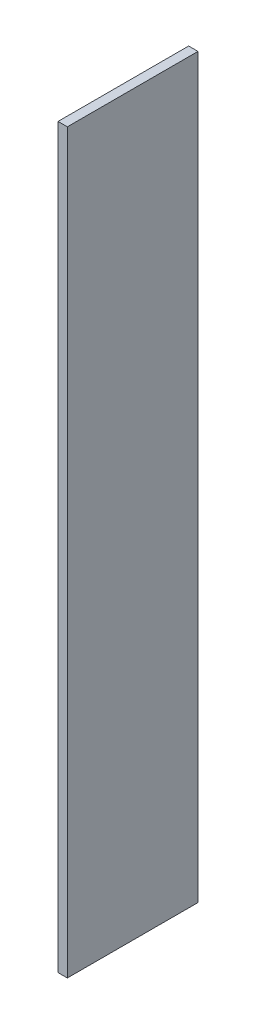
ISO-10303-21;
HEADER;
FILE_DESCRIPTION(('STEP AP214'),'2;1');
FILE_NAME('part.step','',(''),(''),'','','');
FILE_SCHEMA(('AUTOMOTIVE_DESIGN { 1 0 10303 214 1 1 1 1 }'));
ENDSEC;
DATA;
#1=APPLICATION_CONTEXT('core data for automotive mechanical design processes');
#2=APPLICATION_PROTOCOL_DEFINITION('international standard','automotive_design',2000,#1);
#3=PRODUCT_CONTEXT('',#1,'mechanical');
#4=PRODUCT('Part','Part','',(#3));
#5=PRODUCT_RELATED_PRODUCT_CATEGORY('part','',(#4));
#6=PRODUCT_DEFINITION_FORMATION('','',#4);
#7=PRODUCT_DEFINITION_CONTEXT('part definition',#1,'design');
#8=PRODUCT_DEFINITION('design','',#6,#7);
#9=PRODUCT_DEFINITION_SHAPE('','',#8);
#10=(LENGTH_UNIT() NAMED_UNIT(*) SI_UNIT(.MILLI.,.METRE.));
#11=(NAMED_UNIT(*) PLANE_ANGLE_UNIT() SI_UNIT($,.RADIAN.));
#12=(NAMED_UNIT(*) SI_UNIT($,.STERADIAN.) SOLID_ANGLE_UNIT());
#13=UNCERTAINTY_MEASURE_WITH_UNIT(LENGTH_MEASURE(1.E-05),#10,'distance_accuracy_value','');
#14=(GEOMETRIC_REPRESENTATION_CONTEXT(3) GLOBAL_UNCERTAINTY_ASSIGNED_CONTEXT((#13)) GLOBAL_UNIT_ASSIGNED_CONTEXT((#10,
#11,#12)) REPRESENTATION_CONTEXT('',''));
#15=CARTESIAN_POINT('',(0.,0.,0.));
#16=DIRECTION('',(0.,0.,1.));
#17=DIRECTION('',(1.,0.,0.));
#18=AXIS2_PLACEMENT_3D('',#15,#16,#17);
#19=CARTESIAN_POINT('',(6.35,0.,0.));
#20=DIRECTION('',(0.,0.,-1.));
#21=DIRECTION('',(-1.,0.,0.));
#22=AXIS2_PLACEMENT_3D('',#19,#20,#21);
#23=PLANE('',#22);
#24=DIRECTION('',(0.,-1.,0.));
#25=VECTOR('',#24,1.);
#26=CARTESIAN_POINT('',(0.,0.,0.));
#27=LINE('',#26,#25);
#28=CARTESIAN_POINT('',(0.,501.65,0.));
#29=VERTEX_POINT('',#28);
#30=CARTESIAN_POINT('',(0.,0.,0.));
#31=VERTEX_POINT('',#30);
#32=EDGE_CURVE('E97',#29,#31,#27,.T.);
#33=ORIENTED_EDGE('',*,*,#32,.T.);
#34=DIRECTION('',(-1.,0.,0.));
#35=VECTOR('',#34,1.);
#36=CARTESIAN_POINT('',(6.35,0.,0.));
#37=LINE('',#36,#35);
#38=CARTESIAN_POINT('',(6.35,0.,0.));
#39=VERTEX_POINT('',#38);
#40=EDGE_CURVE('E11',#39,#31,#37,.T.);
#41=ORIENTED_EDGE('',*,*,#40,.F.);
#42=DIRECTION('',(0.,-1.,0.));
#43=VECTOR('',#42,1.);
#44=CARTESIAN_POINT('',(6.35,0.,0.));
#45=LINE('',#44,#43);
#46=CARTESIAN_POINT('',(6.35,501.65,0.));
#47=VERTEX_POINT('',#46);
#48=EDGE_CURVE('E85',#47,#39,#45,.T.);
#49=ORIENTED_EDGE('',*,*,#48,.F.);
#50=DIRECTION('',(-1.,0.,0.));
#51=VECTOR('',#50,1.);
#52=CARTESIAN_POINT('',(6.35,501.65,0.));
#53=LINE('',#52,#51);
#54=EDGE_CURVE('E93',#47,#29,#53,.T.);
#55=ORIENTED_EDGE('',*,*,#54,.T.);
#56=EDGE_LOOP('',(#33,#41,#49,#55));
#57=FACE_BOUND('',#56,.T.);
#58=ADVANCED_FACE('F34',(#57),#23,.F.);
#59=CARTESIAN_POINT('',(6.35,0.,0.));
#60=DIRECTION('',(0.,1.,0.));
#61=DIRECTION('',(0.,0.,1.));
#62=AXIS2_PLACEMENT_3D('',#59,#60,#61);
#63=PLANE('',#62);
#64=DIRECTION('',(0.,0.,-1.));
#65=VECTOR('',#64,1.);
#66=CARTESIAN_POINT('',(0.,0.,0.));
#67=LINE('',#66,#65);
#68=CARTESIAN_POINT('',(0.,0.,-88.9));
#69=VERTEX_POINT('',#68);
#70=EDGE_CURVE('E89',#31,#69,#67,.T.);
#71=ORIENTED_EDGE('',*,*,#70,.T.);
#72=DIRECTION('',(-1.,0.,0.));
#73=VECTOR('',#72,1.);
#74=CARTESIAN_POINT('',(6.35,0.,-88.9));
#75=LINE('',#74,#73);
#76=CARTESIAN_POINT('',(6.35,0.,-88.9));
#77=VERTEX_POINT('',#76);
#78=EDGE_CURVE('E42',#77,#69,#75,.T.);
#79=ORIENTED_EDGE('',*,*,#78,.F.);
#80=DIRECTION('',(0.,0.,-1.));
#81=VECTOR('',#80,1.);
#82=CARTESIAN_POINT('',(6.35,0.,0.));
#83=LINE('',#82,#81);
#84=EDGE_CURVE('E80',#39,#77,#83,.T.);
#85=ORIENTED_EDGE('',*,*,#84,.F.);
#86=ORIENTED_EDGE('',*,*,#40,.T.);
#87=EDGE_LOOP('',(#71,#79,#85,#86));
#88=FACE_BOUND('',#87,.T.);
#89=ADVANCED_FACE('F88',(#88),#63,.F.);
#90=CARTESIAN_POINT('',(6.35,0.,-88.9));
#91=DIRECTION('',(0.,0.,1.));
#92=DIRECTION('',(1.,0.,0.));
#93=AXIS2_PLACEMENT_3D('',#90,#91,#92);
#94=PLANE('',#93);
#95=DIRECTION('',(0.,1.,0.));
#96=VECTOR('',#95,1.);
#97=CARTESIAN_POINT('',(0.,0.,-88.9));
#98=LINE('',#97,#96);
#99=CARTESIAN_POINT('',(0.,501.65,-88.9));
#100=VERTEX_POINT('',#99);
#101=EDGE_CURVE('E67',#69,#100,#98,.T.);
#102=ORIENTED_EDGE('',*,*,#101,.T.);
#103=DIRECTION('',(-1.,0.,0.));
#104=VECTOR('',#103,1.);
#105=CARTESIAN_POINT('',(6.35,501.65,-88.9));
#106=LINE('',#105,#104);
#107=CARTESIAN_POINT('',(6.35,501.65,-88.9));
#108=VERTEX_POINT('',#107);
#109=EDGE_CURVE('E90',#108,#100,#106,.T.);
#110=ORIENTED_EDGE('',*,*,#109,.F.);
#111=DIRECTION('',(0.,1.,0.));
#112=VECTOR('',#111,1.);
#113=CARTESIAN_POINT('',(6.35,0.,-88.9));
#114=LINE('',#113,#112);
#115=EDGE_CURVE('E83',#77,#108,#114,.T.);
#116=ORIENTED_EDGE('',*,*,#115,.F.);
#117=ORIENTED_EDGE('',*,*,#78,.T.);
#118=EDGE_LOOP('',(#102,#110,#116,#117));
#119=FACE_BOUND('',#118,.T.);
#120=ADVANCED_FACE('F91',(#119),#94,.F.);
#121=CARTESIAN_POINT('',(6.35,501.65,0.));
#122=DIRECTION('',(0.,-1.,0.));
#123=DIRECTION('',(0.,0.,-1.));
#124=AXIS2_PLACEMENT_3D('',#121,#122,#123);
#125=PLANE('',#124);
#126=DIRECTION('',(0.,0.,1.));
#127=VECTOR('',#126,1.);
#128=CARTESIAN_POINT('',(0.,501.65,0.));
#129=LINE('',#128,#127);
#130=EDGE_CURVE('E73',#100,#29,#129,.T.);
#131=ORIENTED_EDGE('',*,*,#130,.T.);
#132=ORIENTED_EDGE('',*,*,#54,.F.);
#133=DIRECTION('',(0.,0.,1.));
#134=VECTOR('',#133,1.);
#135=CARTESIAN_POINT('',(6.35,501.65,0.));
#136=LINE('',#135,#134);
#137=EDGE_CURVE('E50',#108,#47,#136,.T.);
#138=ORIENTED_EDGE('',*,*,#137,.F.);
#139=ORIENTED_EDGE('',*,*,#109,.T.);
#140=EDGE_LOOP('',(#131,#132,#138,#139));
#141=FACE_BOUND('',#140,.T.);
#142=ADVANCED_FACE('F104',(#141),#125,.F.);
#143=CARTESIAN_POINT('',(6.35,0.,0.));
#144=DIRECTION('',(-1.,0.,0.));
#145=DIRECTION('',(0.,0.,1.));
#146=AXIS2_PLACEMENT_3D('',#143,#144,#145);
#147=PLANE('',#146);
#148=ORIENTED_EDGE('',*,*,#48,.T.);
#149=ORIENTED_EDGE('',*,*,#84,.T.);
#150=ORIENTED_EDGE('',*,*,#115,.T.);
#151=ORIENTED_EDGE('',*,*,#137,.T.);
#152=EDGE_LOOP('',(#148,#149,#150,#151));
#153=FACE_BOUND('',#152,.T.);
#154=ADVANCED_FACE('F81',(#153),#147,.F.);
#155=CARTESIAN_POINT('',(0.,0.,0.));
#156=DIRECTION('',(-1.,0.,0.));
#157=DIRECTION('',(0.,0.,1.));
#158=AXIS2_PLACEMENT_3D('',#155,#156,#157);
#159=PLANE('',#158);
#160=ORIENTED_EDGE('',*,*,#32,.F.);
#161=ORIENTED_EDGE('',*,*,#130,.F.);
#162=ORIENTED_EDGE('',*,*,#101,.F.);
#163=ORIENTED_EDGE('',*,*,#70,.F.);
#164=EDGE_LOOP('',(#160,#161,#162,#163));
#165=FACE_BOUND('',#164,.T.);
#166=ADVANCED_FACE('F107',(#165),#159,.T.);
#167=CLOSED_SHELL('',(#58,#89,#120,#142,#154,#166));
#168=MANIFOLD_SOLID_BREP('B2',#167);
#169=ADVANCED_BREP_SHAPE_REPRESENTATION('',(#18,#168),#14);
#170=SHAPE_DEFINITION_REPRESENTATION(#9,#169);
ENDSEC;
END-ISO-10303-21;
